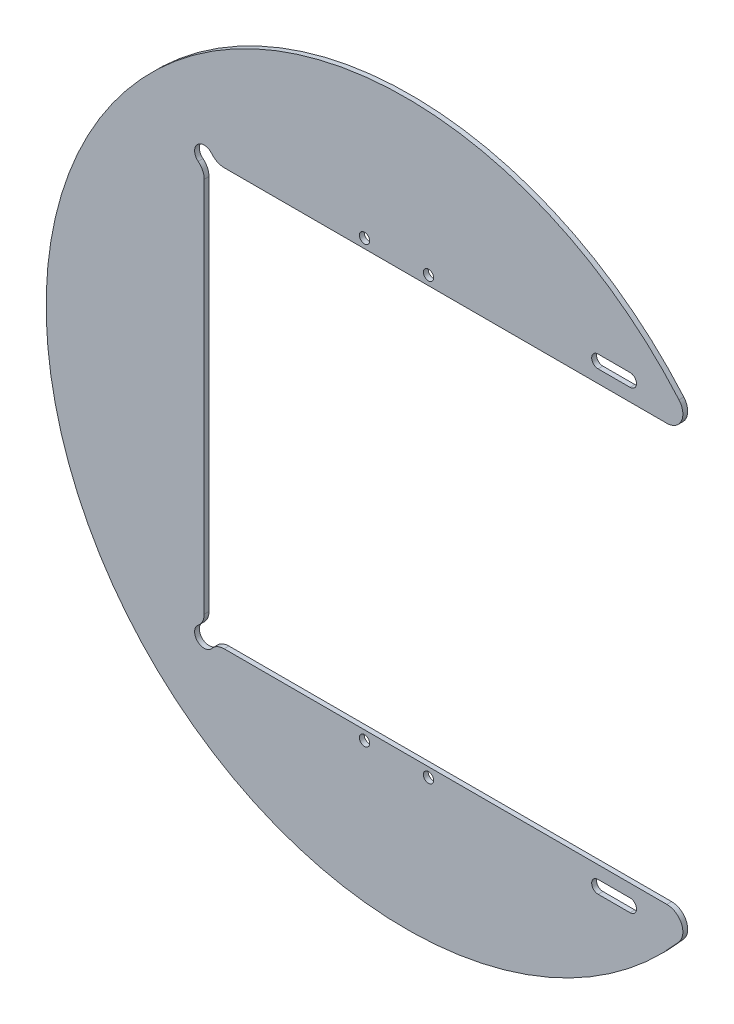
ISO-10303-21;
HEADER;
FILE_DESCRIPTION(('STEP AP214'),'2;1');
FILE_NAME('part.step','',(''),(''),'','','');
FILE_SCHEMA(('AUTOMOTIVE_DESIGN { 1 0 10303 214 1 1 1 1 }'));
ENDSEC;
DATA;
#1=APPLICATION_CONTEXT('core data for automotive mechanical design processes');
#2=APPLICATION_PROTOCOL_DEFINITION('international standard','automotive_design',2000,#1);
#3=PRODUCT_CONTEXT('',#1,'mechanical');
#4=PRODUCT('Part','Part','',(#3));
#5=PRODUCT_RELATED_PRODUCT_CATEGORY('part','',(#4));
#6=PRODUCT_DEFINITION_FORMATION('','',#4);
#7=PRODUCT_DEFINITION_CONTEXT('part definition',#1,'design');
#8=PRODUCT_DEFINITION('design','',#6,#7);
#9=PRODUCT_DEFINITION_SHAPE('','',#8);
#10=(LENGTH_UNIT() NAMED_UNIT(*) SI_UNIT(.MILLI.,.METRE.));
#11=(NAMED_UNIT(*) PLANE_ANGLE_UNIT() SI_UNIT($,.RADIAN.));
#12=(NAMED_UNIT(*) SI_UNIT($,.STERADIAN.) SOLID_ANGLE_UNIT());
#13=UNCERTAINTY_MEASURE_WITH_UNIT(LENGTH_MEASURE(1.E-05),#10,'distance_accuracy_value','');
#14=(GEOMETRIC_REPRESENTATION_CONTEXT(3) GLOBAL_UNCERTAINTY_ASSIGNED_CONTEXT((#13)) GLOBAL_UNIT_ASSIGNED_CONTEXT((#10,
#11,#12)) REPRESENTATION_CONTEXT('',''));
#15=CARTESIAN_POINT('',(0.,0.,0.));
#16=DIRECTION('',(0.,0.,1.));
#17=DIRECTION('',(1.,0.,0.));
#18=AXIS2_PLACEMENT_3D('',#15,#16,#17);
#19=CARTESIAN_POINT('',(0.,0.,1.5));
#20=DIRECTION('',(0.,0.,-1.));
#21=DIRECTION('',(-1.,0.,0.));
#22=AXIS2_PLACEMENT_3D('',#19,#20,#21);
#23=CYLINDRICAL_SURFACE('',#22,112.5);
#24=CARTESIAN_POINT('',(0.,0.,0.));
#25=DIRECTION('',(0.,0.,1.));
#26=DIRECTION('',(1.,0.,0.));
#27=AXIS2_PLACEMENT_3D('',#24,#25,#26);
#28=CIRCLE('',#27,112.5);
#29=CARTESIAN_POINT('',(85.2906334712271,73.3604651162791,0.));
#30=VERTEX_POINT('',#29);
#31=CARTESIAN_POINT('',(85.2906334712271,-73.3604651162791,0.));
#32=VERTEX_POINT('',#31);
#33=EDGE_CURVE('E260',#30,#32,#28,.T.);
#34=ORIENTED_EDGE('',*,*,#33,.T.);
#35=DIRECTION('',(0.,0.,-1.));
#36=VECTOR('',#35,1.);
#37=CARTESIAN_POINT('',(85.2906334712271,-73.3604651162791,1.5));
#38=LINE('',#37,#36);
#39=CARTESIAN_POINT('',(85.2906334712271,-73.3604651162791,1.5));
#40=VERTEX_POINT('',#39);
#41=EDGE_CURVE('E284',#32,#40,#38,.F.);
#42=ORIENTED_EDGE('',*,*,#41,.T.);
#43=CARTESIAN_POINT('',(0.,0.,1.5));
#44=DIRECTION('',(0.,0.,1.));
#45=DIRECTION('',(1.,0.,0.));
#46=AXIS2_PLACEMENT_3D('',#43,#44,#45);
#47=CIRCLE('',#46,112.5);
#48=CARTESIAN_POINT('',(85.2906334712271,73.3604651162791,1.5));
#49=VERTEX_POINT('',#48);
#50=EDGE_CURVE('E256',#49,#40,#47,.T.);
#51=ORIENTED_EDGE('',*,*,#50,.F.);
#52=DIRECTION('',(0.,0.,-1.));
#53=VECTOR('',#52,1.);
#54=CARTESIAN_POINT('',(85.2906334712271,73.3604651162791,1.5));
#55=LINE('',#54,#53);
#56=EDGE_CURVE('E274',#49,#30,#55,.T.);
#57=ORIENTED_EDGE('',*,*,#56,.T.);
#58=EDGE_LOOP('',(#34,#42,#51,#57));
#59=FACE_BOUND('',#58,.T.);
#60=ADVANCED_FACE('F35',(#59),#23,.T.);
#61=CARTESIAN_POINT('',(0.,0.,1.5));
#62=DIRECTION('',(0.,0.,1.));
#63=DIRECTION('',(1.,0.,0.));
#64=AXIS2_PLACEMENT_3D('',#61,#62,#63);
#65=PLANE('',#64);
#66=CARTESIAN_POINT('',(60.,71.1,1.5));
#67=DIRECTION('',(0.,0.,1.));
#68=DIRECTION('',(1.,0.,0.));
#69=AXIS2_PLACEMENT_3D('',#66,#67,#68);
#70=CIRCLE('',#69,2.);
#71=CARTESIAN_POINT('',(60.,73.1,1.5));
#72=VERTEX_POINT('',#71);
#73=CARTESIAN_POINT('',(60.,69.1,1.5));
#74=VERTEX_POINT('',#73);
#75=EDGE_CURVE('E50',#72,#74,#70,.T.);
#76=ORIENTED_EDGE('',*,*,#75,.F.);
#77=DIRECTION('',(-1.,0.,0.));
#78=VECTOR('',#77,1.);
#79=CARTESIAN_POINT('',(60.,73.1,1.5));
#80=LINE('',#79,#78);
#81=CARTESIAN_POINT('',(70.,73.1,1.5));
#82=VERTEX_POINT('',#81);
#83=EDGE_CURVE('E196',#82,#72,#80,.T.);
#84=ORIENTED_EDGE('',*,*,#83,.F.);
#85=CARTESIAN_POINT('',(70.,71.1,1.5));
#86=DIRECTION('',(0.,0.,1.));
#87=DIRECTION('',(1.,0.,0.));
#88=AXIS2_PLACEMENT_3D('',#85,#86,#87);
#89=CIRCLE('',#88,2.);
#90=CARTESIAN_POINT('',(70.,69.1,1.5));
#91=VERTEX_POINT('',#90);
#92=EDGE_CURVE('E179',#91,#82,#89,.T.);
#93=ORIENTED_EDGE('',*,*,#92,.F.);
#94=DIRECTION('',(1.,0.,0.));
#95=VECTOR('',#94,1.);
#96=CARTESIAN_POINT('',(60.,69.1,1.5));
#97=LINE('',#96,#95);
#98=EDGE_CURVE('E189',#74,#91,#97,.T.);
#99=ORIENTED_EDGE('',*,*,#98,.F.);
#100=EDGE_LOOP('',(#76,#84,#93,#99));
#101=FACE_BOUND('',#100,.T.);
#102=CARTESIAN_POINT('',(60.,-71.1,1.5));
#103=DIRECTION('',(0.,0.,1.));
#104=DIRECTION('',(1.,0.,0.));
#105=AXIS2_PLACEMENT_3D('',#102,#103,#104);
#106=CIRCLE('',#105,2.00000000000002);
#107=CARTESIAN_POINT('',(60.,-69.1,1.5));
#108=VERTEX_POINT('',#107);
#109=CARTESIAN_POINT('',(60.,-73.1,1.5));
#110=VERTEX_POINT('',#109);
#111=EDGE_CURVE('E58',#108,#110,#106,.T.);
#112=ORIENTED_EDGE('',*,*,#111,.F.);
#113=DIRECTION('',(-1.,0.,0.));
#114=VECTOR('',#113,1.);
#115=CARTESIAN_POINT('',(60.,-69.1,1.5));
#116=LINE('',#115,#114);
#117=CARTESIAN_POINT('',(70.,-69.1,1.5));
#118=VERTEX_POINT('',#117);
#119=EDGE_CURVE('E213',#118,#108,#116,.T.);
#120=ORIENTED_EDGE('',*,*,#119,.F.);
#121=CARTESIAN_POINT('',(70.,-71.1,1.5));
#122=DIRECTION('',(0.,0.,1.));
#123=DIRECTION('',(1.,0.,0.));
#124=AXIS2_PLACEMENT_3D('',#121,#122,#123);
#125=CIRCLE('',#124,2.00000000000002);
#126=CARTESIAN_POINT('',(70.,-73.1,1.5));
#127=VERTEX_POINT('',#126);
#128=EDGE_CURVE('E210',#127,#118,#125,.T.);
#129=ORIENTED_EDGE('',*,*,#128,.F.);
#130=DIRECTION('',(1.,0.,0.));
#131=VECTOR('',#130,1.);
#132=CARTESIAN_POINT('',(60.,-73.1,1.5));
#133=LINE('',#132,#131);
#134=EDGE_CURVE('E207',#110,#127,#133,.T.);
#135=ORIENTED_EDGE('',*,*,#134,.F.);
#136=EDGE_LOOP('',(#112,#120,#129,#135));
#137=FACE_BOUND('',#136,.T.);
#138=DIRECTION('',(1.,0.,0.));
#139=VECTOR('',#138,1.);
#140=CARTESIAN_POINT('',(112.5,-65.1,1.5));
#141=LINE('',#140,#139);
#142=CARTESIAN_POINT('',(-56.8550020016016,-65.1,1.5));
#143=VERTEX_POINT('',#142);
#144=CARTESIAN_POINT('',(81.4999386502837,-65.1,1.5));
#145=VERTEX_POINT('',#144);
#146=EDGE_CURVE('E243',#143,#145,#141,.T.);
#147=ORIENTED_EDGE('',*,*,#146,.F.);
#148=CARTESIAN_POINT('',(-56.8550020016016,-70.1,1.5));
#149=DIRECTION('',(0.,0.,1.));
#150=DIRECTION('',(1.,0.,0.));
#151=AXIS2_PLACEMENT_3D('',#148,#149,#150);
#152=CIRCLE('',#151,5.);
#153=CARTESIAN_POINT('',(-60.7581257506006,-66.975,1.5));
#154=VERTEX_POINT('',#153);
#155=EDGE_CURVE('E310',#143,#154,#152,.T.);
#156=ORIENTED_EDGE('',*,*,#155,.T.);
#157=CARTESIAN_POINT('',(-63.1,-65.1,1.5));
#158=DIRECTION('',(0.,0.,1.));
#159=DIRECTION('',(1.,0.,0.));
#160=AXIS2_PLACEMENT_3D('',#157,#158,#159);
#161=CIRCLE('',#160,3.);
#162=CARTESIAN_POINT('',(-64.975,-62.7581257506006,1.5));
#163=VERTEX_POINT('',#162);
#164=EDGE_CURVE('E203',#163,#154,#161,.T.);
#165=ORIENTED_EDGE('',*,*,#164,.F.);
#166=CARTESIAN_POINT('',(-68.1,-58.8550020016016,1.5));
#167=DIRECTION('',(0.,0.,1.));
#168=DIRECTION('',(1.,0.,0.));
#169=AXIS2_PLACEMENT_3D('',#166,#167,#168);
#170=CIRCLE('',#169,5.);
#171=CARTESIAN_POINT('',(-63.1,-58.8550020016016,1.5));
#172=VERTEX_POINT('',#171);
#173=EDGE_CURVE('E308',#163,#172,#170,.T.);
#174=ORIENTED_EDGE('',*,*,#173,.T.);
#175=DIRECTION('',(0.,-1.,0.));
#176=VECTOR('',#175,1.);
#177=CARTESIAN_POINT('',(-63.1,-65.1,1.5));
#178=LINE('',#177,#176);
#179=CARTESIAN_POINT('',(-63.1,58.8550020016016,1.5));
#180=VERTEX_POINT('',#179);
#181=EDGE_CURVE('E235',#180,#172,#178,.T.);
#182=ORIENTED_EDGE('',*,*,#181,.F.);
#183=CARTESIAN_POINT('',(-68.1,58.8550020016016,1.5));
#184=DIRECTION('',(0.,0.,1.));
#185=DIRECTION('',(1.,0.,0.));
#186=AXIS2_PLACEMENT_3D('',#183,#184,#185);
#187=CIRCLE('',#186,5.);
#188=CARTESIAN_POINT('',(-64.975,62.7581257506006,1.5));
#189=VERTEX_POINT('',#188);
#190=EDGE_CURVE('E304',#180,#189,#187,.T.);
#191=ORIENTED_EDGE('',*,*,#190,.T.);
#192=CARTESIAN_POINT('',(-63.1,65.1,1.5));
#193=DIRECTION('',(0.,0.,1.));
#194=DIRECTION('',(1.,0.,0.));
#195=AXIS2_PLACEMENT_3D('',#192,#193,#194);
#196=CIRCLE('',#195,3.);
#197=CARTESIAN_POINT('',(-60.7581257506006,66.975,1.5));
#198=VERTEX_POINT('',#197);
#199=EDGE_CURVE('E224',#198,#189,#196,.T.);
#200=ORIENTED_EDGE('',*,*,#199,.F.);
#201=CARTESIAN_POINT('',(-56.8550020016016,70.1,1.5));
#202=DIRECTION('',(0.,0.,1.));
#203=DIRECTION('',(1.,0.,0.));
#204=AXIS2_PLACEMENT_3D('',#201,#202,#203);
#205=CIRCLE('',#204,5.);
#206=CARTESIAN_POINT('',(-56.8550020016016,65.1,1.5));
#207=VERTEX_POINT('',#206);
#208=EDGE_CURVE('E306',#198,#207,#205,.T.);
#209=ORIENTED_EDGE('',*,*,#208,.T.);
#210=DIRECTION('',(-1.,0.,0.));
#211=VECTOR('',#210,1.);
#212=CARTESIAN_POINT('',(112.5,65.1,1.5));
#213=LINE('',#212,#211);
#214=CARTESIAN_POINT('',(81.4999386502837,65.1,1.5));
#215=VERTEX_POINT('',#214);
#216=EDGE_CURVE('E240',#215,#207,#213,.T.);
#217=ORIENTED_EDGE('',*,*,#216,.F.);
#218=CARTESIAN_POINT('',(81.4999386502837,70.1,1.5));
#219=DIRECTION('',(0.,0.,1.));
#220=DIRECTION('',(1.,0.,0.));
#221=AXIS2_PLACEMENT_3D('',#218,#219,#220);
#222=CIRCLE('',#221,5.);
#223=EDGE_CURVE('E287',#215,#49,#222,.T.);
#224=ORIENTED_EDGE('',*,*,#223,.T.);
#225=ORIENTED_EDGE('',*,*,#50,.T.);
#226=CARTESIAN_POINT('',(81.4999386502837,-70.1,1.5));
#227=DIRECTION('',(0.,0.,1.));
#228=DIRECTION('',(1.,0.,0.));
#229=AXIS2_PLACEMENT_3D('',#226,#227,#228);
#230=CIRCLE('',#229,5.);
#231=EDGE_CURVE('E289',#40,#145,#230,.T.);
#232=ORIENTED_EDGE('',*,*,#231,.T.);
#233=EDGE_LOOP('',(#147,#156,#165,#174,#182,#191,#200,#209,#217,#224,#225,#232));
#234=FACE_BOUND('',#233,.T.);
#235=CARTESIAN_POINT('',(7.00000000000001,68.,1.5));
#236=DIRECTION('',(0.,0.,1.));
#237=DIRECTION('',(1.,0.,0.));
#238=AXIS2_PLACEMENT_3D('',#235,#236,#237);
#239=CIRCLE('',#238,1.60000000000001);
#240=CARTESIAN_POINT('',(8.60000000000002,68.,1.5));
#241=VERTEX_POINT('',#240);
#242=EDGE_CURVE('E247',#241,#241,#239,.T.);
#243=ORIENTED_EDGE('',*,*,#242,.F.);
#244=EDGE_LOOP('',(#243));
#245=FACE_BOUND('',#244,.T.);
#246=CARTESIAN_POINT('',(-13.,-68.,1.5));
#247=DIRECTION('',(0.,0.,1.));
#248=DIRECTION('',(1.,0.,0.));
#249=AXIS2_PLACEMENT_3D('',#246,#247,#248);
#250=CIRCLE('',#249,1.60000000000001);
#251=CARTESIAN_POINT('',(-11.4,-68.,1.5));
#252=VERTEX_POINT('',#251);
#253=EDGE_CURVE('E239',#252,#252,#250,.T.);
#254=ORIENTED_EDGE('',*,*,#253,.F.);
#255=EDGE_LOOP('',(#254));
#256=FACE_BOUND('',#255,.T.);
#257=CARTESIAN_POINT('',(7.00000000000001,-68.,1.5));
#258=DIRECTION('',(0.,0.,1.));
#259=DIRECTION('',(1.,0.,0.));
#260=AXIS2_PLACEMENT_3D('',#257,#258,#259);
#261=CIRCLE('',#260,1.60000000000001);
#262=CARTESIAN_POINT('',(8.60000000000002,-68.,1.5));
#263=VERTEX_POINT('',#262);
#264=EDGE_CURVE('E236',#263,#263,#261,.T.);
#265=ORIENTED_EDGE('',*,*,#264,.F.);
#266=EDGE_LOOP('',(#265));
#267=FACE_BOUND('',#266,.T.);
#268=CARTESIAN_POINT('',(-13.,68.,1.5));
#269=DIRECTION('',(0.,0.,1.));
#270=DIRECTION('',(1.,0.,0.));
#271=AXIS2_PLACEMENT_3D('',#268,#269,#270);
#272=CIRCLE('',#271,1.60000000000001);
#273=CARTESIAN_POINT('',(-11.4,68.,1.5));
#274=VERTEX_POINT('',#273);
#275=EDGE_CURVE('E250',#274,#274,#272,.T.);
#276=ORIENTED_EDGE('',*,*,#275,.F.);
#277=EDGE_LOOP('',(#276));
#278=FACE_BOUND('',#277,.T.);
#279=ADVANCED_FACE('F193',(#101,#137,#234,#245,#256,#267,#278),#65,.T.);
#280=CARTESIAN_POINT('',(0.,0.,0.));
#281=DIRECTION('',(0.,0.,1.));
#282=DIRECTION('',(1.,0.,0.));
#283=AXIS2_PLACEMENT_3D('',#280,#281,#282);
#284=PLANE('',#283);
#285=DIRECTION('',(-1.,0.,0.));
#286=VECTOR('',#285,1.);
#287=CARTESIAN_POINT('',(0.,73.1,0.));
#288=LINE('',#287,#286);
#289=CARTESIAN_POINT('',(70.,73.1,0.));
#290=VERTEX_POINT('',#289);
#291=CARTESIAN_POINT('',(60.,73.1,0.));
#292=VERTEX_POINT('',#291);
#293=EDGE_CURVE('E43',#290,#292,#288,.T.);
#294=ORIENTED_EDGE('',*,*,#293,.T.);
#295=CARTESIAN_POINT('',(60.,71.1,0.));
#296=DIRECTION('',(0.,0.,1.));
#297=DIRECTION('',(1.,0.,0.));
#298=AXIS2_PLACEMENT_3D('',#295,#296,#297);
#299=CIRCLE('',#298,2.);
#300=CARTESIAN_POINT('',(60.,69.1,0.));
#301=VERTEX_POINT('',#300);
#302=EDGE_CURVE('E11',#292,#301,#299,.T.);
#303=ORIENTED_EDGE('',*,*,#302,.T.);
#304=DIRECTION('',(1.,0.,0.));
#305=VECTOR('',#304,1.);
#306=CARTESIAN_POINT('',(0.,69.1,0.));
#307=LINE('',#306,#305);
#308=CARTESIAN_POINT('',(70.,69.1,0.));
#309=VERTEX_POINT('',#308);
#310=EDGE_CURVE('E349',#301,#309,#307,.T.);
#311=ORIENTED_EDGE('',*,*,#310,.T.);
#312=CARTESIAN_POINT('',(70.,71.1,0.));
#313=DIRECTION('',(0.,0.,1.));
#314=DIRECTION('',(1.,0.,0.));
#315=AXIS2_PLACEMENT_3D('',#312,#313,#314);
#316=CIRCLE('',#315,2.);
#317=EDGE_CURVE('E182',#309,#290,#316,.T.);
#318=ORIENTED_EDGE('',*,*,#317,.T.);
#319=EDGE_LOOP('',(#294,#303,#311,#318));
#320=FACE_BOUND('',#319,.T.);
#321=DIRECTION('',(-1.,0.,0.));
#322=VECTOR('',#321,1.);
#323=CARTESIAN_POINT('',(0.,-69.1,0.));
#324=LINE('',#323,#322);
#325=CARTESIAN_POINT('',(70.,-69.1,0.));
#326=VERTEX_POINT('',#325);
#327=CARTESIAN_POINT('',(60.,-69.1,0.));
#328=VERTEX_POINT('',#327);
#329=EDGE_CURVE('E343',#326,#328,#324,.T.);
#330=ORIENTED_EDGE('',*,*,#329,.T.);
#331=CARTESIAN_POINT('',(60.,-71.1,0.));
#332=DIRECTION('',(0.,0.,1.));
#333=DIRECTION('',(1.,0.,0.));
#334=AXIS2_PLACEMENT_3D('',#331,#332,#333);
#335=CIRCLE('',#334,2.00000000000002);
#336=CARTESIAN_POINT('',(60.,-73.1,0.));
#337=VERTEX_POINT('',#336);
#338=EDGE_CURVE('E346',#328,#337,#335,.T.);
#339=ORIENTED_EDGE('',*,*,#338,.T.);
#340=DIRECTION('',(1.,0.,0.));
#341=VECTOR('',#340,1.);
#342=CARTESIAN_POINT('',(0.,-73.1,0.));
#343=LINE('',#342,#341);
#344=CARTESIAN_POINT('',(70.,-73.1,0.));
#345=VERTEX_POINT('',#344);
#346=EDGE_CURVE('E337',#337,#345,#343,.T.);
#347=ORIENTED_EDGE('',*,*,#346,.T.);
#348=CARTESIAN_POINT('',(70.,-71.1,0.));
#349=DIRECTION('',(0.,0.,1.));
#350=DIRECTION('',(1.,0.,0.));
#351=AXIS2_PLACEMENT_3D('',#348,#349,#350);
#352=CIRCLE('',#351,2.00000000000002);
#353=EDGE_CURVE('E340',#345,#326,#352,.T.);
#354=ORIENTED_EDGE('',*,*,#353,.T.);
#355=EDGE_LOOP('',(#330,#339,#347,#354));
#356=FACE_BOUND('',#355,.T.);
#357=CARTESIAN_POINT('',(7.00000000000001,68.,0.));
#358=DIRECTION('',(0.,0.,1.));
#359=DIRECTION('',(1.,0.,0.));
#360=AXIS2_PLACEMENT_3D('',#357,#358,#359);
#361=CIRCLE('',#360,1.60000000000001);
#362=CARTESIAN_POINT('',(8.60000000000002,68.,0.));
#363=VERTEX_POINT('',#362);
#364=EDGE_CURVE('E263',#363,#363,#361,.T.);
#365=ORIENTED_EDGE('',*,*,#364,.T.);
#366=EDGE_LOOP('',(#365));
#367=FACE_BOUND('',#366,.T.);
#368=CARTESIAN_POINT('',(-13.,-68.,0.));
#369=DIRECTION('',(0.,0.,1.));
#370=DIRECTION('',(1.,0.,0.));
#371=AXIS2_PLACEMENT_3D('',#368,#369,#370);
#372=CIRCLE('',#371,1.60000000000001);
#373=CARTESIAN_POINT('',(-11.4,-68.,0.));
#374=VERTEX_POINT('',#373);
#375=EDGE_CURVE('E277',#374,#374,#372,.T.);
#376=ORIENTED_EDGE('',*,*,#375,.T.);
#377=EDGE_LOOP('',(#376));
#378=FACE_BOUND('',#377,.T.);
#379=CARTESIAN_POINT('',(7.00000000000001,-68.,0.));
#380=DIRECTION('',(0.,0.,1.));
#381=DIRECTION('',(1.,0.,0.));
#382=AXIS2_PLACEMENT_3D('',#379,#380,#381);
#383=CIRCLE('',#382,1.60000000000001);
#384=CARTESIAN_POINT('',(8.60000000000002,-68.,0.));
#385=VERTEX_POINT('',#384);
#386=EDGE_CURVE('E266',#385,#385,#383,.T.);
#387=ORIENTED_EDGE('',*,*,#386,.T.);
#388=EDGE_LOOP('',(#387));
#389=FACE_BOUND('',#388,.T.);
#390=CARTESIAN_POINT('',(-13.,68.,0.));
#391=DIRECTION('',(0.,0.,1.));
#392=DIRECTION('',(1.,0.,0.));
#393=AXIS2_PLACEMENT_3D('',#390,#391,#392);
#394=CIRCLE('',#393,1.60000000000001);
#395=CARTESIAN_POINT('',(-11.4,68.,0.));
#396=VERTEX_POINT('',#395);
#397=EDGE_CURVE('E255',#396,#396,#394,.T.);
#398=ORIENTED_EDGE('',*,*,#397,.T.);
#399=EDGE_LOOP('',(#398));
#400=FACE_BOUND('',#399,.T.);
#401=CARTESIAN_POINT('',(-63.1,-65.1,0.));
#402=DIRECTION('',(0.,0.,1.));
#403=DIRECTION('',(1.,0.,0.));
#404=AXIS2_PLACEMENT_3D('',#401,#402,#403);
#405=CIRCLE('',#404,3.);
#406=CARTESIAN_POINT('',(-64.975,-62.7581257506006,0.));
#407=VERTEX_POINT('',#406);
#408=CARTESIAN_POINT('',(-60.7581257506006,-66.975,0.));
#409=VERTEX_POINT('',#408);
#410=EDGE_CURVE('E227',#407,#409,#405,.T.);
#411=ORIENTED_EDGE('',*,*,#410,.T.);
#412=CARTESIAN_POINT('',(-56.8550020016016,-70.1,0.));
#413=DIRECTION('',(0.,0.,1.));
#414=DIRECTION('',(1.,0.,0.));
#415=AXIS2_PLACEMENT_3D('',#412,#413,#414);
#416=CIRCLE('',#415,5.);
#417=CARTESIAN_POINT('',(-56.8550020016016,-65.1,0.));
#418=VERTEX_POINT('',#417);
#419=EDGE_CURVE('E322',#409,#418,#416,.F.);
#420=ORIENTED_EDGE('',*,*,#419,.T.);
#421=DIRECTION('',(1.,0.,0.));
#422=VECTOR('',#421,1.);
#423=CARTESIAN_POINT('',(0.,-65.1,0.));
#424=LINE('',#423,#422);
#425=CARTESIAN_POINT('',(81.4999386502837,-65.1,0.));
#426=VERTEX_POINT('',#425);
#427=EDGE_CURVE('E259',#418,#426,#424,.T.);
#428=ORIENTED_EDGE('',*,*,#427,.T.);
#429=CARTESIAN_POINT('',(81.4999386502837,-70.1,0.));
#430=DIRECTION('',(0.,0.,1.));
#431=DIRECTION('',(1.,0.,0.));
#432=AXIS2_PLACEMENT_3D('',#429,#430,#431);
#433=CIRCLE('',#432,5.);
#434=EDGE_CURVE('E297',#426,#32,#433,.F.);
#435=ORIENTED_EDGE('',*,*,#434,.T.);
#436=ORIENTED_EDGE('',*,*,#33,.F.);
#437=CARTESIAN_POINT('',(81.4999386502837,70.1,0.));
#438=DIRECTION('',(0.,0.,1.));
#439=DIRECTION('',(1.,0.,0.));
#440=AXIS2_PLACEMENT_3D('',#437,#438,#439);
#441=CIRCLE('',#440,5.);
#442=CARTESIAN_POINT('',(81.4999386502837,65.1,0.));
#443=VERTEX_POINT('',#442);
#444=EDGE_CURVE('E295',#30,#443,#441,.F.);
#445=ORIENTED_EDGE('',*,*,#444,.T.);
#446=DIRECTION('',(-1.,0.,0.));
#447=VECTOR('',#446,1.);
#448=CARTESIAN_POINT('',(0.,65.1,0.));
#449=LINE('',#448,#447);
#450=CARTESIAN_POINT('',(-56.8550020016016,65.1,0.));
#451=VERTEX_POINT('',#450);
#452=EDGE_CURVE('E271',#443,#451,#449,.T.);
#453=ORIENTED_EDGE('',*,*,#452,.T.);
#454=CARTESIAN_POINT('',(-56.8550020016016,70.1,0.));
#455=DIRECTION('',(0.,0.,1.));
#456=DIRECTION('',(1.,0.,0.));
#457=AXIS2_PLACEMENT_3D('',#454,#455,#456);
#458=CIRCLE('',#457,5.);
#459=CARTESIAN_POINT('',(-60.7581257506006,66.975,0.));
#460=VERTEX_POINT('',#459);
#461=EDGE_CURVE('E318',#451,#460,#458,.F.);
#462=ORIENTED_EDGE('',*,*,#461,.T.);
#463=CARTESIAN_POINT('',(-63.1,65.1,0.));
#464=DIRECTION('',(0.,0.,1.));
#465=DIRECTION('',(1.,0.,0.));
#466=AXIS2_PLACEMENT_3D('',#463,#464,#465);
#467=CIRCLE('',#466,3.);
#468=CARTESIAN_POINT('',(-64.975,62.7581257506006,0.));
#469=VERTEX_POINT('',#468);
#470=EDGE_CURVE('E232',#460,#469,#467,.T.);
#471=ORIENTED_EDGE('',*,*,#470,.T.);
#472=CARTESIAN_POINT('',(-68.1,58.8550020016016,0.));
#473=DIRECTION('',(0.,0.,1.));
#474=DIRECTION('',(1.,0.,0.));
#475=AXIS2_PLACEMENT_3D('',#472,#473,#474);
#476=CIRCLE('',#475,5.);
#477=CARTESIAN_POINT('',(-63.1,58.8550020016016,0.));
#478=VERTEX_POINT('',#477);
#479=EDGE_CURVE('E316',#469,#478,#476,.F.);
#480=ORIENTED_EDGE('',*,*,#479,.T.);
#481=DIRECTION('',(0.,-1.,0.));
#482=VECTOR('',#481,1.);
#483=CARTESIAN_POINT('',(-63.1,0.,0.));
#484=LINE('',#483,#482);
#485=CARTESIAN_POINT('',(-63.1,-58.8550020016016,0.));
#486=VERTEX_POINT('',#485);
#487=EDGE_CURVE('E268',#478,#486,#484,.T.);
#488=ORIENTED_EDGE('',*,*,#487,.T.);
#489=CARTESIAN_POINT('',(-68.1,-58.8550020016016,0.));
#490=DIRECTION('',(0.,0.,1.));
#491=DIRECTION('',(1.,0.,0.));
#492=AXIS2_PLACEMENT_3D('',#489,#490,#491);
#493=CIRCLE('',#492,5.);
#494=EDGE_CURVE('E320',#486,#407,#493,.F.);
#495=ORIENTED_EDGE('',*,*,#494,.T.);
#496=EDGE_LOOP('',(#411,#420,#428,#435,#436,#445,#453,#462,#471,#480,#488,#495));
#497=FACE_BOUND('',#496,.T.);
#498=ADVANCED_FACE('F353',(#320,#356,#367,#378,#389,#400,#497),#284,.F.);
#499=CARTESIAN_POINT('',(-13.,68.,-8.5));
#500=DIRECTION('',(0.,0.,1.));
#501=DIRECTION('',(1.,0.,0.));
#502=AXIS2_PLACEMENT_3D('',#499,#500,#501);
#503=CYLINDRICAL_SURFACE('',#502,1.60000000000001);
#504=ORIENTED_EDGE('',*,*,#275,.T.);
#505=EDGE_LOOP('',(#504));
#506=FACE_BOUND('',#505,.T.);
#507=ORIENTED_EDGE('',*,*,#397,.F.);
#508=EDGE_LOOP('',(#507));
#509=FACE_BOUND('',#508,.T.);
#510=ADVANCED_FACE('F469',(#506,#509),#503,.F.);
#511=CARTESIAN_POINT('',(-63.1,-65.1,-8.5));
#512=DIRECTION('',(-1.,0.,0.));
#513=DIRECTION('',(0.,-1.,0.));
#514=AXIS2_PLACEMENT_3D('',#511,#512,#513);
#515=PLANE('',#514);
#516=ORIENTED_EDGE('',*,*,#181,.T.);
#517=DIRECTION('',(0.,0.,1.));
#518=VECTOR('',#517,1.);
#519=CARTESIAN_POINT('',(-63.1,-58.8550020016016,-8.5));
#520=LINE('',#519,#518);
#521=EDGE_CURVE('E327',#172,#486,#520,.F.);
#522=ORIENTED_EDGE('',*,*,#521,.T.);
#523=ORIENTED_EDGE('',*,*,#487,.F.);
#524=DIRECTION('',(0.,0.,1.));
#525=VECTOR('',#524,1.);
#526=CARTESIAN_POINT('',(-63.1,58.8550020016016,-8.5));
#527=LINE('',#526,#525);
#528=EDGE_CURVE('E324',#478,#180,#527,.T.);
#529=ORIENTED_EDGE('',*,*,#528,.T.);
#530=EDGE_LOOP('',(#516,#522,#523,#529));
#531=FACE_BOUND('',#530,.T.);
#532=ADVANCED_FACE('F443',(#531),#515,.F.);
#533=CARTESIAN_POINT('',(112.5,65.1,-8.5));
#534=DIRECTION('',(0.,1.,0.));
#535=DIRECTION('',(-1.,0.,0.));
#536=AXIS2_PLACEMENT_3D('',#533,#534,#535);
#537=PLANE('',#536);
#538=ORIENTED_EDGE('',*,*,#216,.T.);
#539=DIRECTION('',(0.,0.,1.));
#540=VECTOR('',#539,1.);
#541=CARTESIAN_POINT('',(-56.8550020016016,65.1,-8.5));
#542=LINE('',#541,#540);
#543=EDGE_CURVE('E330',#207,#451,#542,.F.);
#544=ORIENTED_EDGE('',*,*,#543,.T.);
#545=ORIENTED_EDGE('',*,*,#452,.F.);
#546=DIRECTION('',(0.,0.,-1.));
#547=VECTOR('',#546,1.);
#548=CARTESIAN_POINT('',(81.4999386502837,65.1,-8.5));
#549=LINE('',#548,#547);
#550=EDGE_CURVE('E299',#443,#215,#549,.F.);
#551=ORIENTED_EDGE('',*,*,#550,.T.);
#552=EDGE_LOOP('',(#538,#544,#545,#551));
#553=FACE_BOUND('',#552,.T.);
#554=ADVANCED_FACE('F419',(#553),#537,.F.);
#555=CARTESIAN_POINT('',(112.5,-65.1,-8.5));
#556=DIRECTION('',(0.,-1.,0.));
#557=DIRECTION('',(1.,0.,0.));
#558=AXIS2_PLACEMENT_3D('',#555,#556,#557);
#559=PLANE('',#558);
#560=ORIENTED_EDGE('',*,*,#427,.F.);
#561=DIRECTION('',(0.,0.,1.));
#562=VECTOR('',#561,1.);
#563=CARTESIAN_POINT('',(-56.8550020016016,-65.1,-8.5));
#564=LINE('',#563,#562);
#565=EDGE_CURVE('E301',#418,#143,#564,.T.);
#566=ORIENTED_EDGE('',*,*,#565,.T.);
#567=ORIENTED_EDGE('',*,*,#146,.T.);
#568=DIRECTION('',(0.,0.,-1.));
#569=VECTOR('',#568,1.);
#570=CARTESIAN_POINT('',(81.4999386502837,-65.1,-8.5));
#571=LINE('',#570,#569);
#572=EDGE_CURVE('E292',#145,#426,#571,.T.);
#573=ORIENTED_EDGE('',*,*,#572,.T.);
#574=EDGE_LOOP('',(#560,#566,#567,#573));
#575=FACE_BOUND('',#574,.T.);
#576=ADVANCED_FACE('F431',(#575),#559,.F.);
#577=CARTESIAN_POINT('',(7.00000000000001,-68.,-8.5));
#578=DIRECTION('',(0.,0.,1.));
#579=DIRECTION('',(1.,0.,0.));
#580=AXIS2_PLACEMENT_3D('',#577,#578,#579);
#581=CYLINDRICAL_SURFACE('',#580,1.60000000000001);
#582=ORIENTED_EDGE('',*,*,#264,.T.);
#583=EDGE_LOOP('',(#582));
#584=FACE_BOUND('',#583,.T.);
#585=ORIENTED_EDGE('',*,*,#386,.F.);
#586=EDGE_LOOP('',(#585));
#587=FACE_BOUND('',#586,.T.);
#588=ADVANCED_FACE('F458',(#584,#587),#581,.F.);
#589=CARTESIAN_POINT('',(-13.,-68.,-8.5));
#590=DIRECTION('',(0.,0.,1.));
#591=DIRECTION('',(1.,0.,0.));
#592=AXIS2_PLACEMENT_3D('',#589,#590,#591);
#593=CYLINDRICAL_SURFACE('',#592,1.60000000000001);
#594=ORIENTED_EDGE('',*,*,#253,.T.);
#595=EDGE_LOOP('',(#594));
#596=FACE_BOUND('',#595,.T.);
#597=ORIENTED_EDGE('',*,*,#375,.F.);
#598=EDGE_LOOP('',(#597));
#599=FACE_BOUND('',#598,.T.);
#600=ADVANCED_FACE('F461',(#596,#599),#593,.F.);
#601=CARTESIAN_POINT('',(7.00000000000001,68.,-8.5));
#602=DIRECTION('',(0.,0.,1.));
#603=DIRECTION('',(1.,0.,0.));
#604=AXIS2_PLACEMENT_3D('',#601,#602,#603);
#605=CYLINDRICAL_SURFACE('',#604,1.60000000000001);
#606=ORIENTED_EDGE('',*,*,#242,.T.);
#607=EDGE_LOOP('',(#606));
#608=FACE_BOUND('',#607,.T.);
#609=ORIENTED_EDGE('',*,*,#364,.F.);
#610=EDGE_LOOP('',(#609));
#611=FACE_BOUND('',#610,.T.);
#612=ADVANCED_FACE('F387',(#608,#611),#605,.F.);
#613=CARTESIAN_POINT('',(81.4999386502837,-70.1,1.5));
#614=DIRECTION('',(0.,0.,-1.));
#615=DIRECTION('',(-1.,0.,0.));
#616=AXIS2_PLACEMENT_3D('',#613,#614,#615);
#617=CYLINDRICAL_SURFACE('',#616,5.);
#618=ORIENTED_EDGE('',*,*,#434,.F.);
#619=ORIENTED_EDGE('',*,*,#572,.F.);
#620=ORIENTED_EDGE('',*,*,#231,.F.);
#621=ORIENTED_EDGE('',*,*,#41,.F.);
#622=EDGE_LOOP('',(#618,#619,#620,#621));
#623=FACE_BOUND('',#622,.T.);
#624=ADVANCED_FACE('F383',(#623),#617,.T.);
#625=CARTESIAN_POINT('',(81.4999386502837,70.1,1.5));
#626=DIRECTION('',(0.,0.,-1.));
#627=DIRECTION('',(-1.,0.,0.));
#628=AXIS2_PLACEMENT_3D('',#625,#626,#627);
#629=CYLINDRICAL_SURFACE('',#628,5.);
#630=ORIENTED_EDGE('',*,*,#223,.F.);
#631=ORIENTED_EDGE('',*,*,#550,.F.);
#632=ORIENTED_EDGE('',*,*,#444,.F.);
#633=ORIENTED_EDGE('',*,*,#56,.F.);
#634=EDGE_LOOP('',(#630,#631,#632,#633));
#635=FACE_BOUND('',#634,.T.);
#636=ADVANCED_FACE('F386',(#635),#629,.T.);
#637=CARTESIAN_POINT('',(-63.1,-65.1,-8.5));
#638=DIRECTION('',(0.,0.,1.));
#639=DIRECTION('',(1.,0.,0.));
#640=AXIS2_PLACEMENT_3D('',#637,#638,#639);
#641=CYLINDRICAL_SURFACE('',#640,3.);
#642=ORIENTED_EDGE('',*,*,#164,.T.);
#643=DIRECTION('',(0.,0.,1.));
#644=VECTOR('',#643,1.);
#645=CARTESIAN_POINT('',(-60.7581257506006,-66.975,-8.5));
#646=LINE('',#645,#644);
#647=EDGE_CURVE('E314',#154,#409,#646,.F.);
#648=ORIENTED_EDGE('',*,*,#647,.T.);
#649=ORIENTED_EDGE('',*,*,#410,.F.);
#650=DIRECTION('',(0.,0.,1.));
#651=VECTOR('',#650,1.);
#652=CARTESIAN_POINT('',(-64.975,-62.7581257506006,-8.5));
#653=LINE('',#652,#651);
#654=EDGE_CURVE('E312',#407,#163,#653,.T.);
#655=ORIENTED_EDGE('',*,*,#654,.T.);
#656=EDGE_LOOP('',(#642,#648,#649,#655));
#657=FACE_BOUND('',#656,.T.);
#658=ADVANCED_FACE('F391',(#657),#641,.F.);
#659=CARTESIAN_POINT('',(-63.1,65.1,-8.5));
#660=DIRECTION('',(0.,0.,1.));
#661=DIRECTION('',(1.,0.,0.));
#662=AXIS2_PLACEMENT_3D('',#659,#660,#661);
#663=CYLINDRICAL_SURFACE('',#662,3.);
#664=ORIENTED_EDGE('',*,*,#470,.F.);
#665=DIRECTION('',(0.,0.,1.));
#666=VECTOR('',#665,1.);
#667=CARTESIAN_POINT('',(-60.7581257506006,66.975,-8.5));
#668=LINE('',#667,#666);
#669=EDGE_CURVE('E335',#460,#198,#668,.T.);
#670=ORIENTED_EDGE('',*,*,#669,.T.);
#671=ORIENTED_EDGE('',*,*,#199,.T.);
#672=DIRECTION('',(0.,0.,1.));
#673=VECTOR('',#672,1.);
#674=CARTESIAN_POINT('',(-64.975,62.7581257506006,-8.5));
#675=LINE('',#674,#673);
#676=EDGE_CURVE('E333',#189,#469,#675,.F.);
#677=ORIENTED_EDGE('',*,*,#676,.T.);
#678=EDGE_LOOP('',(#664,#670,#671,#677));
#679=FACE_BOUND('',#678,.T.);
#680=ADVANCED_FACE('F397',(#679),#663,.F.);
#681=CARTESIAN_POINT('',(-56.8550020016016,-70.1,-8.5));
#682=DIRECTION('',(0.,0.,1.));
#683=DIRECTION('',(1.,0.,0.));
#684=AXIS2_PLACEMENT_3D('',#681,#682,#683);
#685=CYLINDRICAL_SURFACE('',#684,5.);
#686=ORIENTED_EDGE('',*,*,#419,.F.);
#687=ORIENTED_EDGE('',*,*,#647,.F.);
#688=ORIENTED_EDGE('',*,*,#155,.F.);
#689=ORIENTED_EDGE('',*,*,#565,.F.);
#690=EDGE_LOOP('',(#686,#687,#688,#689));
#691=FACE_BOUND('',#690,.T.);
#692=ADVANCED_FACE('F393',(#691),#685,.T.);
#693=CARTESIAN_POINT('',(-68.1,-58.8550020016016,-8.5));
#694=DIRECTION('',(0.,0.,1.));
#695=DIRECTION('',(1.,0.,0.));
#696=AXIS2_PLACEMENT_3D('',#693,#694,#695);
#697=CYLINDRICAL_SURFACE('',#696,5.);
#698=ORIENTED_EDGE('',*,*,#173,.F.);
#699=ORIENTED_EDGE('',*,*,#654,.F.);
#700=ORIENTED_EDGE('',*,*,#494,.F.);
#701=ORIENTED_EDGE('',*,*,#521,.F.);
#702=EDGE_LOOP('',(#698,#699,#700,#701));
#703=FACE_BOUND('',#702,.T.);
#704=ADVANCED_FACE('F396',(#703),#697,.T.);
#705=CARTESIAN_POINT('',(-56.8550020016016,70.1,-8.5));
#706=DIRECTION('',(0.,0.,1.));
#707=DIRECTION('',(1.,0.,0.));
#708=AXIS2_PLACEMENT_3D('',#705,#706,#707);
#709=CYLINDRICAL_SURFACE('',#708,5.);
#710=ORIENTED_EDGE('',*,*,#208,.F.);
#711=ORIENTED_EDGE('',*,*,#669,.F.);
#712=ORIENTED_EDGE('',*,*,#461,.F.);
#713=ORIENTED_EDGE('',*,*,#543,.F.);
#714=EDGE_LOOP('',(#710,#711,#712,#713));
#715=FACE_BOUND('',#714,.T.);
#716=ADVANCED_FACE('F400',(#715),#709,.T.);
#717=CARTESIAN_POINT('',(-68.1,58.8550020016016,-8.5));
#718=DIRECTION('',(0.,0.,1.));
#719=DIRECTION('',(1.,0.,0.));
#720=AXIS2_PLACEMENT_3D('',#717,#718,#719);
#721=CYLINDRICAL_SURFACE('',#720,5.);
#722=ORIENTED_EDGE('',*,*,#479,.F.);
#723=ORIENTED_EDGE('',*,*,#676,.F.);
#724=ORIENTED_EDGE('',*,*,#190,.F.);
#725=ORIENTED_EDGE('',*,*,#528,.F.);
#726=EDGE_LOOP('',(#722,#723,#724,#725));
#727=FACE_BOUND('',#726,.T.);
#728=ADVANCED_FACE('F37',(#727),#721,.T.);
#729=CARTESIAN_POINT('',(60.,-71.1,-8.5));
#730=DIRECTION('',(0.,0.,1.));
#731=DIRECTION('',(1.,0.,0.));
#732=AXIS2_PLACEMENT_3D('',#729,#730,#731);
#733=CYLINDRICAL_SURFACE('',#732,2.00000000000002);
#734=DIRECTION('',(0.,0.,1.));
#735=VECTOR('',#734,1.);
#736=CARTESIAN_POINT('',(60.,-69.1,-8.5));
#737=LINE('',#736,#735);
#738=EDGE_CURVE('E217',#328,#108,#737,.T.);
#739=ORIENTED_EDGE('',*,*,#738,.T.);
#740=ORIENTED_EDGE('',*,*,#111,.T.);
#741=DIRECTION('',(0.,0.,1.));
#742=VECTOR('',#741,1.);
#743=CARTESIAN_POINT('',(60.,-73.1,-8.5));
#744=LINE('',#743,#742);
#745=EDGE_CURVE('E216',#337,#110,#744,.T.);
#746=ORIENTED_EDGE('',*,*,#745,.F.);
#747=ORIENTED_EDGE('',*,*,#338,.F.);
#748=EDGE_LOOP('',(#739,#740,#746,#747));
#749=FACE_BOUND('',#748,.T.);
#750=ADVANCED_FACE('F407',(#749),#733,.F.);
#751=CARTESIAN_POINT('',(60.,-69.1,-8.5));
#752=DIRECTION('',(0.,1.,0.));
#753=DIRECTION('',(0.,0.,1.));
#754=AXIS2_PLACEMENT_3D('',#751,#752,#753);
#755=PLANE('',#754);
#756=DIRECTION('',(0.,0.,1.));
#757=VECTOR('',#756,1.);
#758=CARTESIAN_POINT('',(70.,-69.1,-8.5));
#759=LINE('',#758,#757);
#760=EDGE_CURVE('E219',#326,#118,#759,.T.);
#761=ORIENTED_EDGE('',*,*,#760,.T.);
#762=ORIENTED_EDGE('',*,*,#119,.T.);
#763=ORIENTED_EDGE('',*,*,#738,.F.);
#764=ORIENTED_EDGE('',*,*,#329,.F.);
#765=EDGE_LOOP('',(#761,#762,#763,#764));
#766=FACE_BOUND('',#765,.T.);
#767=ADVANCED_FACE('F499',(#766),#755,.F.);
#768=CARTESIAN_POINT('',(70.,-71.1,-8.5));
#769=DIRECTION('',(0.,0.,1.));
#770=DIRECTION('',(1.,0.,0.));
#771=AXIS2_PLACEMENT_3D('',#768,#769,#770);
#772=CYLINDRICAL_SURFACE('',#771,2.00000000000002);
#773=DIRECTION('',(0.,0.,1.));
#774=VECTOR('',#773,1.);
#775=CARTESIAN_POINT('',(70.,-73.1,-8.5));
#776=LINE('',#775,#774);
#777=EDGE_CURVE('E221',#345,#127,#776,.T.);
#778=ORIENTED_EDGE('',*,*,#777,.T.);
#779=ORIENTED_EDGE('',*,*,#128,.T.);
#780=ORIENTED_EDGE('',*,*,#760,.F.);
#781=ORIENTED_EDGE('',*,*,#353,.F.);
#782=EDGE_LOOP('',(#778,#779,#780,#781));
#783=FACE_BOUND('',#782,.T.);
#784=ADVANCED_FACE('F367',(#783),#772,.F.);
#785=CARTESIAN_POINT('',(60.,-73.1,-8.5));
#786=DIRECTION('',(0.,-1.,0.));
#787=DIRECTION('',(0.,0.,-1.));
#788=AXIS2_PLACEMENT_3D('',#785,#786,#787);
#789=PLANE('',#788);
#790=ORIENTED_EDGE('',*,*,#745,.T.);
#791=ORIENTED_EDGE('',*,*,#134,.T.);
#792=ORIENTED_EDGE('',*,*,#777,.F.);
#793=ORIENTED_EDGE('',*,*,#346,.F.);
#794=EDGE_LOOP('',(#790,#791,#792,#793));
#795=FACE_BOUND('',#794,.T.);
#796=ADVANCED_FACE('F360',(#795),#789,.F.);
#797=CARTESIAN_POINT('',(60.,71.1,-8.5));
#798=DIRECTION('',(0.,0.,1.));
#799=DIRECTION('',(1.,0.,0.));
#800=AXIS2_PLACEMENT_3D('',#797,#798,#799);
#801=CYLINDRICAL_SURFACE('',#800,2.);
#802=DIRECTION('',(0.,0.,1.));
#803=VECTOR('',#802,1.);
#804=CARTESIAN_POINT('',(60.,73.1,-8.5));
#805=LINE('',#804,#803);
#806=EDGE_CURVE('E201',#292,#72,#805,.T.);
#807=ORIENTED_EDGE('',*,*,#806,.T.);
#808=ORIENTED_EDGE('',*,*,#75,.T.);
#809=DIRECTION('',(0.,0.,1.));
#810=VECTOR('',#809,1.);
#811=CARTESIAN_POINT('',(60.,69.1,-8.5));
#812=LINE('',#811,#810);
#813=EDGE_CURVE('E186',#301,#74,#812,.T.);
#814=ORIENTED_EDGE('',*,*,#813,.F.);
#815=ORIENTED_EDGE('',*,*,#302,.F.);
#816=EDGE_LOOP('',(#807,#808,#814,#815));
#817=FACE_BOUND('',#816,.T.);
#818=ADVANCED_FACE('F358',(#817),#801,.F.);
#819=CARTESIAN_POINT('',(60.,73.1,-8.5));
#820=DIRECTION('',(0.,1.,0.));
#821=DIRECTION('',(0.,0.,1.));
#822=AXIS2_PLACEMENT_3D('',#819,#820,#821);
#823=PLANE('',#822);
#824=DIRECTION('',(0.,0.,1.));
#825=VECTOR('',#824,1.);
#826=CARTESIAN_POINT('',(70.,73.1,-8.5));
#827=LINE('',#826,#825);
#828=EDGE_CURVE('E185',#290,#82,#827,.T.);
#829=ORIENTED_EDGE('',*,*,#828,.T.);
#830=ORIENTED_EDGE('',*,*,#83,.T.);
#831=ORIENTED_EDGE('',*,*,#806,.F.);
#832=ORIENTED_EDGE('',*,*,#293,.F.);
#833=EDGE_LOOP('',(#829,#830,#831,#832));
#834=FACE_BOUND('',#833,.T.);
#835=ADVANCED_FACE('F357',(#834),#823,.F.);
#836=CARTESIAN_POINT('',(70.,71.1,-8.5));
#837=DIRECTION('',(0.,0.,1.));
#838=DIRECTION('',(1.,0.,0.));
#839=AXIS2_PLACEMENT_3D('',#836,#837,#838);
#840=CYLINDRICAL_SURFACE('',#839,2.);
#841=DIRECTION('',(0.,0.,1.));
#842=VECTOR('',#841,1.);
#843=CARTESIAN_POINT('',(70.,69.1,-8.5));
#844=LINE('',#843,#842);
#845=EDGE_CURVE('E174',#309,#91,#844,.T.);
#846=ORIENTED_EDGE('',*,*,#845,.T.);
#847=ORIENTED_EDGE('',*,*,#92,.T.);
#848=ORIENTED_EDGE('',*,*,#828,.F.);
#849=ORIENTED_EDGE('',*,*,#317,.F.);
#850=EDGE_LOOP('',(#846,#847,#848,#849));
#851=FACE_BOUND('',#850,.T.);
#852=ADVANCED_FACE('F176',(#851),#840,.F.);
#853=CARTESIAN_POINT('',(60.,69.1,-8.5));
#854=DIRECTION('',(0.,-1.,0.));
#855=DIRECTION('',(0.,0.,-1.));
#856=AXIS2_PLACEMENT_3D('',#853,#854,#855);
#857=PLANE('',#856);
#858=ORIENTED_EDGE('',*,*,#813,.T.);
#859=ORIENTED_EDGE('',*,*,#98,.T.);
#860=ORIENTED_EDGE('',*,*,#845,.F.);
#861=ORIENTED_EDGE('',*,*,#310,.F.);
#862=EDGE_LOOP('',(#858,#859,#860,#861));
#863=FACE_BOUND('',#862,.T.);
#864=ADVANCED_FACE('F190',(#863),#857,.F.);
#865=CLOSED_SHELL('',(#60,#279,#498,#510,#532,#554,#576,#588,#600,#612,#624,#636,#658,#680,#692,
#704,#716,#728,#750,#767,#784,#796,#818,#835,#852,#864));
#866=MANIFOLD_SOLID_BREP('B2',#865);
#867=ADVANCED_BREP_SHAPE_REPRESENTATION('',(#18,#866),#14);
#868=SHAPE_DEFINITION_REPRESENTATION(#9,#867);
ENDSEC;
END-ISO-10303-21;
